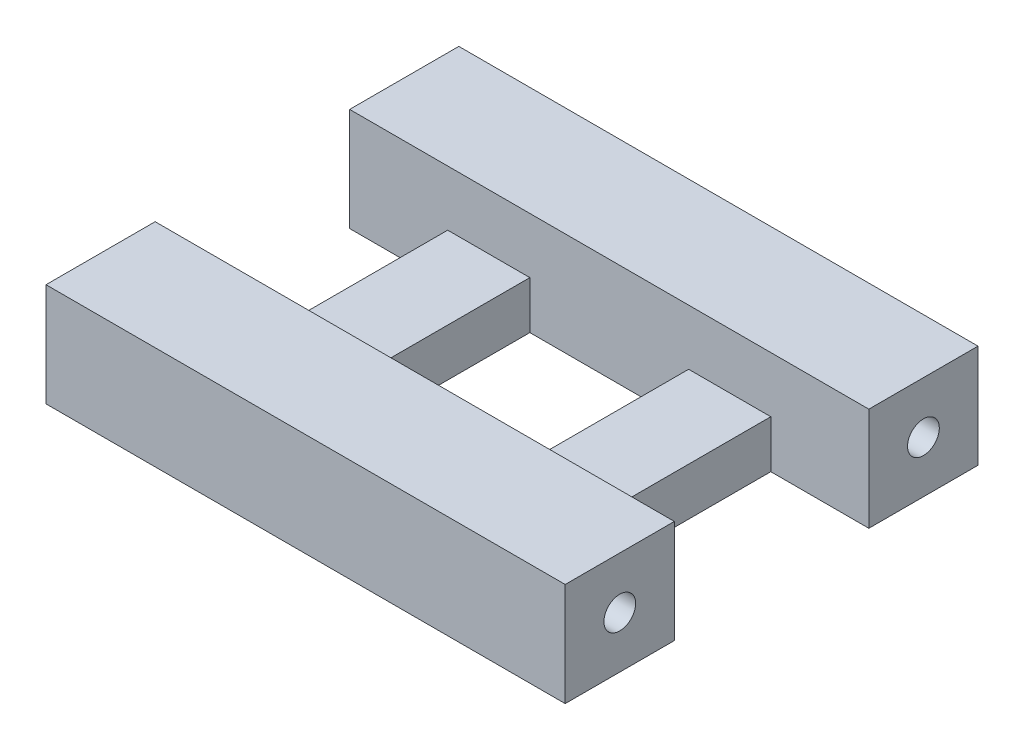
ISO-10303-21;
HEADER;
FILE_DESCRIPTION(('STEP AP214'),'2;1');
FILE_NAME('part.step','',(''),(''),'','','');
FILE_SCHEMA(('AUTOMOTIVE_DESIGN { 1 0 10303 214 1 1 1 1 }'));
ENDSEC;
DATA;
#1=APPLICATION_CONTEXT('core data for automotive mechanical design processes');
#2=APPLICATION_PROTOCOL_DEFINITION('international standard','automotive_design',2000,#1);
#3=PRODUCT_CONTEXT('',#1,'mechanical');
#4=PRODUCT('Part','Part','',(#3));
#5=PRODUCT_RELATED_PRODUCT_CATEGORY('part','',(#4));
#6=PRODUCT_DEFINITION_FORMATION('','',#4);
#7=PRODUCT_DEFINITION_CONTEXT('part definition',#1,'design');
#8=PRODUCT_DEFINITION('design','',#6,#7);
#9=PRODUCT_DEFINITION_SHAPE('','',#8);
#10=(LENGTH_UNIT() NAMED_UNIT(*) SI_UNIT(.MILLI.,.METRE.));
#11=(NAMED_UNIT(*) PLANE_ANGLE_UNIT() SI_UNIT($,.RADIAN.));
#12=(NAMED_UNIT(*) SI_UNIT($,.STERADIAN.) SOLID_ANGLE_UNIT());
#13=UNCERTAINTY_MEASURE_WITH_UNIT(LENGTH_MEASURE(1.E-05),#10,'distance_accuracy_value','');
#14=(GEOMETRIC_REPRESENTATION_CONTEXT(3) GLOBAL_UNCERTAINTY_ASSIGNED_CONTEXT((#13)) GLOBAL_UNIT_ASSIGNED_CONTEXT((#10,
#11,#12)) REPRESENTATION_CONTEXT('',''));
#15=CARTESIAN_POINT('',(0.,0.,0.));
#16=DIRECTION('',(0.,0.,1.));
#17=DIRECTION('',(1.,0.,0.));
#18=AXIS2_PLACEMENT_3D('',#15,#16,#17);
#19=CARTESIAN_POINT('',(0.,6.5,0.));
#20=DIRECTION('',(0.,1.,0.));
#21=DIRECTION('',(0.,0.,1.));
#22=AXIS2_PLACEMENT_3D('',#19,#20,#21);
#23=PLANE('',#22);
#24=DIRECTION('',(1.,0.,0.));
#25=VECTOR('',#24,1.);
#26=CARTESIAN_POINT('',(-15.6068074108547,6.5,-6.74432747551287));
#27=LINE('',#26,#25);
#28=CARTESIAN_POINT('',(-15.6068074108547,6.5,-6.74432747551287));
#29=VERTEX_POINT('',#28);
#30=CARTESIAN_POINT('',(17.0931933520853,6.5,-6.74432747551061));
#31=VERTEX_POINT('',#30);
#32=EDGE_CURVE('E234',#29,#31,#27,.T.);
#33=ORIENTED_EDGE('',*,*,#32,.T.);
#34=DIRECTION('',(0.,0.,-1.));
#35=VECTOR('',#34,1.);
#36=CARTESIAN_POINT('',(17.0931933520853,6.5,-6.74432747551061));
#37=LINE('',#36,#35);
#38=CARTESIAN_POINT('',(17.0931933520853,6.5,-13.6193274755129));
#39=VERTEX_POINT('',#38);
#40=EDGE_CURVE('E245',#31,#39,#37,.T.);
#41=ORIENTED_EDGE('',*,*,#40,.T.);
#42=DIRECTION('',(-1.,0.,0.));
#43=VECTOR('',#42,1.);
#44=CARTESIAN_POINT('',(17.0931933520853,6.5,-13.6193274755129));
#45=LINE('',#44,#43);
#46=CARTESIAN_POINT('',(-15.6068074108547,6.5,-13.6193274755129));
#47=VERTEX_POINT('',#46);
#48=EDGE_CURVE('E228',#39,#47,#45,.T.);
#49=ORIENTED_EDGE('',*,*,#48,.T.);
#50=DIRECTION('',(0.,0.,1.));
#51=VECTOR('',#50,1.);
#52=CARTESIAN_POINT('',(-15.6068074108547,6.5,-13.6193274755129));
#53=LINE('',#52,#51);
#54=EDGE_CURVE('E231',#47,#29,#53,.T.);
#55=ORIENTED_EDGE('',*,*,#54,.T.);
#56=EDGE_LOOP('',(#33,#41,#49,#55));
#57=FACE_BOUND('',#56,.T.);
#58=ADVANCED_FACE('F37',(#57),#23,.T.);
#59=DIRECTION('',(0.,0.,-1.));
#60=VECTOR('',#59,1.);
#61=CARTESIAN_POINT('',(17.093193352086,6.5,12.3806725244867));
#62=LINE('',#61,#60);
#63=CARTESIAN_POINT('',(17.093193352086,6.5,12.3806725244867));
#64=VERTEX_POINT('',#63);
#65=CARTESIAN_POINT('',(17.093193352086,6.5,5.50567252448893));
#66=VERTEX_POINT('',#65);
#67=EDGE_CURVE('E242',#64,#66,#62,.T.);
#68=ORIENTED_EDGE('',*,*,#67,.T.);
#69=DIRECTION('',(-1.,0.,0.));
#70=VECTOR('',#69,1.);
#71=CARTESIAN_POINT('',(-9.43180722011978,6.5,5.50567252448691));
#72=LINE('',#71,#70);
#73=CARTESIAN_POINT('',(-15.606807410854,6.5,5.50567252448715));
#74=VERTEX_POINT('',#73);
#75=EDGE_CURVE('E236',#66,#74,#72,.T.);
#76=ORIENTED_EDGE('',*,*,#75,.T.);
#77=DIRECTION('',(0.,0.,1.));
#78=VECTOR('',#77,1.);
#79=CARTESIAN_POINT('',(-15.606807410854,6.5,5.50567252448715));
#80=LINE('',#79,#78);
#81=CARTESIAN_POINT('',(-15.606807410854,6.5,12.3806725244867));
#82=VERTEX_POINT('',#81);
#83=EDGE_CURVE('E238',#74,#82,#80,.T.);
#84=ORIENTED_EDGE('',*,*,#83,.T.);
#85=DIRECTION('',(1.,0.,0.));
#86=VECTOR('',#85,1.);
#87=CARTESIAN_POINT('',(-15.606807410854,6.5,12.3806725244867));
#88=LINE('',#87,#86);
#89=EDGE_CURVE('E240',#82,#64,#88,.T.);
#90=ORIENTED_EDGE('',*,*,#89,.T.);
#91=EDGE_LOOP('',(#68,#76,#84,#90));
#92=FACE_BOUND('',#91,.T.);
#93=ADVANCED_FACE('F350',(#92),#23,.T.);
#94=CARTESIAN_POINT('',(0.,0.,0.));
#95=DIRECTION('',(0.,1.,0.));
#96=DIRECTION('',(0.,0.,1.));
#97=AXIS2_PLACEMENT_3D('',#94,#95,#96);
#98=PLANE('',#97);
#99=DIRECTION('',(-1.,0.,0.));
#100=VECTOR('',#99,1.);
#101=CARTESIAN_POINT('',(17.0931933520853,0.,-13.6193274755129));
#102=LINE('',#101,#100);
#103=CARTESIAN_POINT('',(17.0931933520853,0.,-13.6193274755129));
#104=VERTEX_POINT('',#103);
#105=CARTESIAN_POINT('',(-15.6068074108547,0.,-13.6193274755129));
#106=VERTEX_POINT('',#105);
#107=EDGE_CURVE('E227',#104,#106,#102,.T.);
#108=ORIENTED_EDGE('',*,*,#107,.F.);
#109=DIRECTION('',(0.,0.,-1.));
#110=VECTOR('',#109,1.);
#111=CARTESIAN_POINT('',(17.0931933520853,0.,-6.74432747551061));
#112=LINE('',#111,#110);
#113=CARTESIAN_POINT('',(17.0931933520853,0.,-6.74432747551061));
#114=VERTEX_POINT('',#113);
#115=EDGE_CURVE('E232',#114,#104,#112,.T.);
#116=ORIENTED_EDGE('',*,*,#115,.F.);
#117=DIRECTION('',(1.,0.,0.));
#118=VECTOR('',#117,1.);
#119=CARTESIAN_POINT('',(10.918193161346,0.,-6.74432747551061));
#120=LINE('',#119,#118);
#121=CARTESIAN_POINT('',(10.918193161346,0.,-6.74432747551061));
#122=VERTEX_POINT('',#121);
#123=EDGE_CURVE('E272',#122,#114,#120,.T.);
#124=ORIENTED_EDGE('',*,*,#123,.F.);
#125=DIRECTION('',(0.,0.,-1.));
#126=VECTOR('',#125,1.);
#127=CARTESIAN_POINT('',(10.918193161346,0.,5.50567252448893));
#128=LINE('',#127,#126);
#129=CARTESIAN_POINT('',(10.918193161346,0.,5.50567252448893));
#130=VERTEX_POINT('',#129);
#131=EDGE_CURVE('E172',#130,#122,#128,.T.);
#132=ORIENTED_EDGE('',*,*,#131,.F.);
#133=DIRECTION('',(-1.,0.,0.));
#134=VECTOR('',#133,1.);
#135=CARTESIAN_POINT('',(17.093193352086,0.,5.50567252448893));
#136=LINE('',#135,#134);
#137=CARTESIAN_POINT('',(17.093193352086,0.,5.50567252448893));
#138=VERTEX_POINT('',#137);
#139=EDGE_CURVE('E268',#138,#130,#136,.T.);
#140=ORIENTED_EDGE('',*,*,#139,.F.);
#141=DIRECTION('',(0.,0.,-1.));
#142=VECTOR('',#141,1.);
#143=CARTESIAN_POINT('',(17.093193352086,0.,12.3806725244867));
#144=LINE('',#143,#142);
#145=CARTESIAN_POINT('',(17.093193352086,0.,12.3806725244867));
#146=VERTEX_POINT('',#145);
#147=EDGE_CURVE('E265',#146,#138,#144,.T.);
#148=ORIENTED_EDGE('',*,*,#147,.F.);
#149=DIRECTION('',(1.,0.,0.));
#150=VECTOR('',#149,1.);
#151=CARTESIAN_POINT('',(-15.606807410854,0.,12.3806725244867));
#152=LINE('',#151,#150);
#153=CARTESIAN_POINT('',(-15.606807410854,0.,12.3806725244867));
#154=VERTEX_POINT('',#153);
#155=EDGE_CURVE('E263',#154,#146,#152,.T.);
#156=ORIENTED_EDGE('',*,*,#155,.F.);
#157=DIRECTION('',(0.,0.,1.));
#158=VECTOR('',#157,1.);
#159=CARTESIAN_POINT('',(-15.606807410854,0.,5.50567252448715));
#160=LINE('',#159,#158);
#161=CARTESIAN_POINT('',(-15.606807410854,0.,5.50567252448715));
#162=VERTEX_POINT('',#161);
#163=EDGE_CURVE('E261',#162,#154,#160,.T.);
#164=ORIENTED_EDGE('',*,*,#163,.F.);
#165=DIRECTION('',(-1.,0.,0.));
#166=VECTOR('',#165,1.);
#167=CARTESIAN_POINT('',(-9.43180722011978,0.,5.50567252448691));
#168=LINE('',#167,#166);
#169=CARTESIAN_POINT('',(-9.43180722011978,0.,5.50567252448691));
#170=VERTEX_POINT('',#169);
#171=EDGE_CURVE('E258',#170,#162,#168,.T.);
#172=ORIENTED_EDGE('',*,*,#171,.F.);
#173=DIRECTION('',(0.,0.,1.));
#174=VECTOR('',#173,1.);
#175=CARTESIAN_POINT('',(-9.43180722011978,0.,-6.74432747551287));
#176=LINE('',#175,#174);
#177=CARTESIAN_POINT('',(-9.43180722011978,0.,-6.74432747551287));
#178=VERTEX_POINT('',#177);
#179=EDGE_CURVE('E255',#178,#170,#176,.T.);
#180=ORIENTED_EDGE('',*,*,#179,.F.);
#181=DIRECTION('',(1.,0.,0.));
#182=VECTOR('',#181,1.);
#183=CARTESIAN_POINT('',(-15.6068074108547,0.,-6.74432747551287));
#184=LINE('',#183,#182);
#185=CARTESIAN_POINT('',(-15.6068074108547,0.,-6.74432747551287));
#186=VERTEX_POINT('',#185);
#187=EDGE_CURVE('E252',#186,#178,#184,.T.);
#188=ORIENTED_EDGE('',*,*,#187,.F.);
#189=DIRECTION('',(0.,0.,1.));
#190=VECTOR('',#189,1.);
#191=CARTESIAN_POINT('',(-15.6068074108547,0.,-13.6193274755129));
#192=LINE('',#191,#190);
#193=EDGE_CURVE('E249',#106,#186,#192,.T.);
#194=ORIENTED_EDGE('',*,*,#193,.F.);
#195=EDGE_LOOP('',(#108,#116,#124,#132,#140,#148,#156,#164,#172,#180,#188,#194));
#196=FACE_BOUND('',#195,.T.);
#197=DIRECTION('',(0.,0.,1.));
#198=VECTOR('',#197,1.);
#199=CARTESIAN_POINT('',(-4.25680702938396,0.,-6.74432747551274));
#200=LINE('',#199,#198);
#201=CARTESIAN_POINT('',(-4.25680702938396,0.,-6.74432747551274));
#202=VERTEX_POINT('',#201);
#203=CARTESIAN_POINT('',(-4.25680702938396,0.,5.50567252448682));
#204=VERTEX_POINT('',#203);
#205=EDGE_CURVE('E201',#202,#204,#200,.T.);
#206=ORIENTED_EDGE('',*,*,#205,.T.);
#207=DIRECTION('',(1.,0.,0.));
#208=VECTOR('',#207,1.);
#209=CARTESIAN_POINT('',(-4.25680702938396,0.,5.50567252448682));
#210=LINE('',#209,#208);
#211=CARTESIAN_POINT('',(5.74319297061473,0.,5.50567252448682));
#212=VERTEX_POINT('',#211);
#213=EDGE_CURVE('E211',#204,#212,#210,.T.);
#214=ORIENTED_EDGE('',*,*,#213,.T.);
#215=DIRECTION('',(0.,0.,-1.));
#216=VECTOR('',#215,1.);
#217=CARTESIAN_POINT('',(5.74319297061473,0.,-6.74432747551274));
#218=LINE('',#217,#216);
#219=CARTESIAN_POINT('',(5.74319297061473,0.,-6.74432747551274));
#220=VERTEX_POINT('',#219);
#221=EDGE_CURVE('E214',#212,#220,#218,.T.);
#222=ORIENTED_EDGE('',*,*,#221,.T.);
#223=DIRECTION('',(-1.,0.,0.));
#224=VECTOR('',#223,1.);
#225=CARTESIAN_POINT('',(-4.25680702938396,0.,-6.74432747551274));
#226=LINE('',#225,#224);
#227=EDGE_CURVE('E217',#220,#202,#226,.T.);
#228=ORIENTED_EDGE('',*,*,#227,.T.);
#229=EDGE_LOOP('',(#206,#214,#222,#228));
#230=FACE_BOUND('',#229,.T.);
#231=ADVANCED_FACE('F284',(#196,#230),#98,.F.);
#232=CARTESIAN_POINT('',(17.0931933520853,6.5,-13.6193274755129));
#233=DIRECTION('',(0.,0.,1.));
#234=DIRECTION('',(1.,0.,0.));
#235=AXIS2_PLACEMENT_3D('',#232,#233,#234);
#236=PLANE('',#235);
#237=ORIENTED_EDGE('',*,*,#107,.T.);
#238=DIRECTION('',(0.,-1.,0.));
#239=VECTOR('',#238,1.);
#240=CARTESIAN_POINT('',(-15.6068074108547,6.5,-13.6193274755129));
#241=LINE('',#240,#239);
#242=EDGE_CURVE('E11',#47,#106,#241,.T.);
#243=ORIENTED_EDGE('',*,*,#242,.F.);
#244=ORIENTED_EDGE('',*,*,#48,.F.);
#245=DIRECTION('',(0.,-1.,0.));
#246=VECTOR('',#245,1.);
#247=CARTESIAN_POINT('',(17.0931933520853,6.5,-13.6193274755129));
#248=LINE('',#247,#246);
#249=EDGE_CURVE('E179',#39,#104,#248,.T.);
#250=ORIENTED_EDGE('',*,*,#249,.T.);
#251=EDGE_LOOP('',(#237,#243,#244,#250));
#252=FACE_BOUND('',#251,.T.);
#253=ADVANCED_FACE('F39',(#252),#236,.F.);
#254=CARTESIAN_POINT('',(-15.6068074108547,6.5,-13.6193274755129));
#255=DIRECTION('',(1.,0.,0.));
#256=DIRECTION('',(0.,0.,-1.));
#257=AXIS2_PLACEMENT_3D('',#254,#255,#256);
#258=PLANE('',#257);
#259=CARTESIAN_POINT('',(-15.6068074108547,3.25,-10.1818274755129));
#260=DIRECTION('',(-1.,0.,0.));
#261=DIRECTION('',(0.,0.,1.));
#262=AXIS2_PLACEMENT_3D('',#259,#260,#261);
#263=CIRCLE('',#262,1.);
#264=CARTESIAN_POINT('',(-15.6068074108547,3.25,-9.18182747551287));
#265=VERTEX_POINT('',#264);
#266=EDGE_CURVE('E328',#265,#265,#263,.T.);
#267=ORIENTED_EDGE('',*,*,#266,.F.);
#268=EDGE_LOOP('',(#267));
#269=FACE_BOUND('',#268,.T.);
#270=ORIENTED_EDGE('',*,*,#193,.T.);
#271=DIRECTION('',(0.,-1.,0.));
#272=VECTOR('',#271,1.);
#273=CARTESIAN_POINT('',(-15.6068074108547,6.5,-6.74432747551287));
#274=LINE('',#273,#272);
#275=EDGE_CURVE('E46',#29,#186,#274,.T.);
#276=ORIENTED_EDGE('',*,*,#275,.F.);
#277=ORIENTED_EDGE('',*,*,#54,.F.);
#278=ORIENTED_EDGE('',*,*,#242,.T.);
#279=EDGE_LOOP('',(#270,#276,#277,#278));
#280=FACE_BOUND('',#279,.T.);
#281=ADVANCED_FACE('F290',(#269,#280),#258,.F.);
#282=CARTESIAN_POINT('',(-9.43180722011978,6.5,-6.74432747551287));
#283=DIRECTION('',(1.,0.,0.));
#284=DIRECTION('',(0.,0.,-1.));
#285=AXIS2_PLACEMENT_3D('',#282,#283,#284);
#286=PLANE('',#285);
#287=DIRECTION('',(0.,-1.,0.));
#288=VECTOR('',#287,1.);
#289=CARTESIAN_POINT('',(-9.43180722011978,6.5,5.50567252448691));
#290=LINE('',#289,#288);
#291=CARTESIAN_POINT('',(-9.43180722011978,3.,5.50567252448715));
#292=VERTEX_POINT('',#291);
#293=EDGE_CURVE('E192',#292,#170,#290,.T.);
#294=ORIENTED_EDGE('',*,*,#293,.F.);
#295=DIRECTION('',(0.,0.,-1.));
#296=VECTOR('',#295,1.);
#297=CARTESIAN_POINT('',(-9.43180722011978,3.,-6.74432747551287));
#298=LINE('',#297,#296);
#299=CARTESIAN_POINT('',(-9.43180722011978,3.,-6.74432747551287));
#300=VERTEX_POINT('',#299);
#301=EDGE_CURVE('E157',#292,#300,#298,.T.);
#302=ORIENTED_EDGE('',*,*,#301,.T.);
#303=DIRECTION('',(0.,-1.,0.));
#304=VECTOR('',#303,1.);
#305=CARTESIAN_POINT('',(-9.43180722011978,6.5,-6.74432747551287));
#306=LINE('',#305,#304);
#307=EDGE_CURVE('E194',#300,#178,#306,.T.);
#308=ORIENTED_EDGE('',*,*,#307,.T.);
#309=ORIENTED_EDGE('',*,*,#179,.T.);
#310=EDGE_LOOP('',(#294,#302,#308,#309));
#311=FACE_BOUND('',#310,.T.);
#312=ADVANCED_FACE('F316',(#311),#286,.F.);
#313=CARTESIAN_POINT('',(-15.606807410854,6.5,5.50567252448715));
#314=DIRECTION('',(1.,0.,0.));
#315=DIRECTION('',(0.,0.,-1.));
#316=AXIS2_PLACEMENT_3D('',#313,#314,#315);
#317=PLANE('',#316);
#318=CARTESIAN_POINT('',(-15.6068074108547,3.25,8.9431725244869));
#319=DIRECTION('',(-1.,0.,0.));
#320=DIRECTION('',(0.,0.,1.));
#321=AXIS2_PLACEMENT_3D('',#318,#319,#320);
#322=CIRCLE('',#321,1.);
#323=CARTESIAN_POINT('',(-15.6068074108547,3.25,9.94317252448691));
#324=VERTEX_POINT('',#323);
#325=EDGE_CURVE('E331',#324,#324,#322,.T.);
#326=ORIENTED_EDGE('',*,*,#325,.F.);
#327=EDGE_LOOP('',(#326));
#328=FACE_BOUND('',#327,.T.);
#329=ORIENTED_EDGE('',*,*,#163,.T.);
#330=DIRECTION('',(0.,-1.,0.));
#331=VECTOR('',#330,1.);
#332=CARTESIAN_POINT('',(-15.606807410854,6.5,12.3806725244867));
#333=LINE('',#332,#331);
#334=EDGE_CURVE('E187',#82,#154,#333,.T.);
#335=ORIENTED_EDGE('',*,*,#334,.F.);
#336=ORIENTED_EDGE('',*,*,#83,.F.);
#337=DIRECTION('',(0.,-1.,0.));
#338=VECTOR('',#337,1.);
#339=CARTESIAN_POINT('',(-15.606807410854,6.5,5.50567252448715));
#340=LINE('',#339,#338);
#341=EDGE_CURVE('E190',#74,#162,#340,.T.);
#342=ORIENTED_EDGE('',*,*,#341,.T.);
#343=EDGE_LOOP('',(#329,#335,#336,#342));
#344=FACE_BOUND('',#343,.T.);
#345=ADVANCED_FACE('F313',(#328,#344),#317,.F.);
#346=CARTESIAN_POINT('',(-15.606807410854,6.5,12.3806725244867));
#347=DIRECTION('',(0.,0.,-1.));
#348=DIRECTION('',(-1.,0.,0.));
#349=AXIS2_PLACEMENT_3D('',#346,#347,#348);
#350=PLANE('',#349);
#351=ORIENTED_EDGE('',*,*,#155,.T.);
#352=DIRECTION('',(0.,-1.,0.));
#353=VECTOR('',#352,1.);
#354=CARTESIAN_POINT('',(17.093193352086,6.5,12.3806725244867));
#355=LINE('',#354,#353);
#356=EDGE_CURVE('E184',#64,#146,#355,.T.);
#357=ORIENTED_EDGE('',*,*,#356,.F.);
#358=ORIENTED_EDGE('',*,*,#89,.F.);
#359=ORIENTED_EDGE('',*,*,#334,.T.);
#360=EDGE_LOOP('',(#351,#357,#358,#359));
#361=FACE_BOUND('',#360,.T.);
#362=ADVANCED_FACE('F308',(#361),#350,.F.);
#363=CARTESIAN_POINT('',(17.093193352086,6.5,12.3806725244867));
#364=DIRECTION('',(-1.,0.,0.));
#365=DIRECTION('',(0.,0.,1.));
#366=AXIS2_PLACEMENT_3D('',#363,#364,#365);
#367=PLANE('',#366);
#368=CARTESIAN_POINT('',(17.093193352086,3.25,8.9431725244869));
#369=DIRECTION('',(-1.,0.,0.));
#370=DIRECTION('',(0.,0.,1.));
#371=AXIS2_PLACEMENT_3D('',#368,#369,#370);
#372=CIRCLE('',#371,1.);
#373=CARTESIAN_POINT('',(17.093193352086,3.25,9.94317252448691));
#374=VERTEX_POINT('',#373);
#375=EDGE_CURVE('E41',#374,#374,#372,.T.);
#376=ORIENTED_EDGE('',*,*,#375,.T.);
#377=EDGE_LOOP('',(#376));
#378=FACE_BOUND('',#377,.T.);
#379=ORIENTED_EDGE('',*,*,#147,.T.);
#380=DIRECTION('',(0.,-1.,0.));
#381=VECTOR('',#380,1.);
#382=CARTESIAN_POINT('',(17.093193352086,6.5,5.50567252448893));
#383=LINE('',#382,#381);
#384=EDGE_CURVE('E177',#66,#138,#383,.T.);
#385=ORIENTED_EDGE('',*,*,#384,.F.);
#386=ORIENTED_EDGE('',*,*,#67,.F.);
#387=ORIENTED_EDGE('',*,*,#356,.T.);
#388=EDGE_LOOP('',(#379,#385,#386,#387));
#389=FACE_BOUND('',#388,.T.);
#390=ADVANCED_FACE('F304',(#378,#389),#367,.F.);
#391=CARTESIAN_POINT('',(17.093193352086,6.5,5.50567252448893));
#392=DIRECTION('',(0.,0.,1.));
#393=DIRECTION('',(1.,0.,0.));
#394=AXIS2_PLACEMENT_3D('',#391,#392,#393);
#395=PLANE('',#394);
#396=DIRECTION('',(0.,-1.,0.));
#397=VECTOR('',#396,1.);
#398=CARTESIAN_POINT('',(10.918193161346,6.5,5.50567252448893));
#399=LINE('',#398,#397);
#400=CARTESIAN_POINT('',(10.918193161346,3.,5.50567252448715));
#401=VERTEX_POINT('',#400);
#402=EDGE_CURVE('E174',#401,#130,#399,.T.);
#403=ORIENTED_EDGE('',*,*,#402,.F.);
#404=DIRECTION('',(-1.,0.,0.));
#405=VECTOR('',#404,1.);
#406=CARTESIAN_POINT('',(19.7931925891453,3.,5.50567252448715));
#407=LINE('',#406,#405);
#408=CARTESIAN_POINT('',(5.74319297061473,3.,5.50567252448715));
#409=VERTEX_POINT('',#408);
#410=EDGE_CURVE('E153',#401,#409,#407,.T.);
#411=ORIENTED_EDGE('',*,*,#410,.T.);
#412=DIRECTION('',(0.,-1.,0.));
#413=VECTOR('',#412,1.);
#414=CARTESIAN_POINT('',(5.74319297061473,6.5,5.50567252448682));
#415=LINE('',#414,#413);
#416=EDGE_CURVE('E223',#409,#212,#415,.T.);
#417=ORIENTED_EDGE('',*,*,#416,.T.);
#418=ORIENTED_EDGE('',*,*,#213,.F.);
#419=DIRECTION('',(0.,-1.,0.));
#420=VECTOR('',#419,1.);
#421=CARTESIAN_POINT('',(-4.25680702938396,6.5,5.50567252448682));
#422=LINE('',#421,#420);
#423=CARTESIAN_POINT('',(-4.25680702938396,3.,5.50567252448682));
#424=VERTEX_POINT('',#423);
#425=EDGE_CURVE('E225',#424,#204,#422,.T.);
#426=ORIENTED_EDGE('',*,*,#425,.F.);
#427=EDGE_CURVE('E54',#424,#292,#407,.T.);
#428=ORIENTED_EDGE('',*,*,#427,.T.);
#429=ORIENTED_EDGE('',*,*,#293,.T.);
#430=ORIENTED_EDGE('',*,*,#171,.T.);
#431=ORIENTED_EDGE('',*,*,#341,.F.);
#432=ORIENTED_EDGE('',*,*,#75,.F.);
#433=ORIENTED_EDGE('',*,*,#384,.T.);
#434=ORIENTED_EDGE('',*,*,#139,.T.);
#435=EDGE_LOOP('',(#403,#411,#417,#418,#426,#428,#429,#430,#431,#432,#433,#434));
#436=FACE_BOUND('',#435,.T.);
#437=ADVANCED_FACE('F299',(#436),#395,.F.);
#438=CARTESIAN_POINT('',(10.918193161346,6.5,5.50567252448893));
#439=DIRECTION('',(-1.,0.,0.));
#440=DIRECTION('',(0.,0.,1.));
#441=AXIS2_PLACEMENT_3D('',#438,#439,#440);
#442=PLANE('',#441);
#443=DIRECTION('',(0.,-1.,0.));
#444=VECTOR('',#443,1.);
#445=CARTESIAN_POINT('',(10.918193161346,6.5,-6.74432747551061));
#446=LINE('',#445,#444);
#447=CARTESIAN_POINT('',(10.918193161346,3.,-6.74432747551287));
#448=VERTEX_POINT('',#447);
#449=EDGE_CURVE('E164',#448,#122,#446,.T.);
#450=ORIENTED_EDGE('',*,*,#449,.F.);
#451=DIRECTION('',(0.,0.,1.));
#452=VECTOR('',#451,1.);
#453=CARTESIAN_POINT('',(10.918193161346,3.,5.50567252448893));
#454=LINE('',#453,#452);
#455=EDGE_CURVE('E150',#448,#401,#454,.T.);
#456=ORIENTED_EDGE('',*,*,#455,.T.);
#457=ORIENTED_EDGE('',*,*,#402,.T.);
#458=ORIENTED_EDGE('',*,*,#131,.T.);
#459=EDGE_LOOP('',(#450,#456,#457,#458));
#460=FACE_BOUND('',#459,.T.);
#461=ADVANCED_FACE('F170',(#460),#442,.F.);
#462=CARTESIAN_POINT('',(10.918193161346,6.5,-6.74432747551061));
#463=DIRECTION('',(0.,0.,-1.));
#464=DIRECTION('',(-1.,0.,0.));
#465=AXIS2_PLACEMENT_3D('',#462,#463,#464);
#466=PLANE('',#465);
#467=ORIENTED_EDGE('',*,*,#123,.T.);
#468=DIRECTION('',(0.,-1.,0.));
#469=VECTOR('',#468,1.);
#470=CARTESIAN_POINT('',(17.0931933520853,6.5,-6.74432747551061));
#471=LINE('',#470,#469);
#472=EDGE_CURVE('E175',#31,#114,#471,.T.);
#473=ORIENTED_EDGE('',*,*,#472,.F.);
#474=ORIENTED_EDGE('',*,*,#32,.F.);
#475=ORIENTED_EDGE('',*,*,#275,.T.);
#476=ORIENTED_EDGE('',*,*,#187,.T.);
#477=ORIENTED_EDGE('',*,*,#307,.F.);
#478=DIRECTION('',(-1.,0.,0.));
#479=VECTOR('',#478,1.);
#480=CARTESIAN_POINT('',(19.7931925891453,3.,-6.74432747551287));
#481=LINE('',#480,#479);
#482=CARTESIAN_POINT('',(-4.25680702938397,3.,-6.74432747551287));
#483=VERTEX_POINT('',#482);
#484=EDGE_CURVE('E168',#483,#300,#481,.T.);
#485=ORIENTED_EDGE('',*,*,#484,.F.);
#486=DIRECTION('',(0.,-1.,0.));
#487=VECTOR('',#486,1.);
#488=CARTESIAN_POINT('',(-4.25680702938396,6.5,-6.74432747551274));
#489=LINE('',#488,#487);
#490=EDGE_CURVE('E220',#483,#202,#489,.T.);
#491=ORIENTED_EDGE('',*,*,#490,.T.);
#492=ORIENTED_EDGE('',*,*,#227,.F.);
#493=DIRECTION('',(0.,-1.,0.));
#494=VECTOR('',#493,1.);
#495=CARTESIAN_POINT('',(5.74319297061473,6.5,-6.74432747551274));
#496=LINE('',#495,#494);
#497=CARTESIAN_POINT('',(5.74319297061473,3.,-6.74432747551274));
#498=VERTEX_POINT('',#497);
#499=EDGE_CURVE('E167',#498,#220,#496,.T.);
#500=ORIENTED_EDGE('',*,*,#499,.F.);
#501=EDGE_CURVE('E62',#448,#498,#481,.T.);
#502=ORIENTED_EDGE('',*,*,#501,.F.);
#503=ORIENTED_EDGE('',*,*,#449,.T.);
#504=EDGE_LOOP('',(#467,#473,#474,#475,#476,#477,#485,#491,#492,#500,#502,#503));
#505=FACE_BOUND('',#504,.T.);
#506=ADVANCED_FACE('F163',(#505),#466,.F.);
#507=CARTESIAN_POINT('',(17.0931933520853,6.5,-6.74432747551061));
#508=DIRECTION('',(-1.,0.,0.));
#509=DIRECTION('',(0.,0.,1.));
#510=AXIS2_PLACEMENT_3D('',#507,#508,#509);
#511=PLANE('',#510);
#512=CARTESIAN_POINT('',(17.0931933520853,3.25,-10.1818274755129));
#513=DIRECTION('',(-1.,0.,0.));
#514=DIRECTION('',(0.,0.,1.));
#515=AXIS2_PLACEMENT_3D('',#512,#513,#514);
#516=CIRCLE('',#515,1.);
#517=CARTESIAN_POINT('',(17.0931933520853,3.25,-9.18182747551287));
#518=VERTEX_POINT('',#517);
#519=EDGE_CURVE('E196',#518,#518,#516,.T.);
#520=ORIENTED_EDGE('',*,*,#519,.T.);
#521=EDGE_LOOP('',(#520));
#522=FACE_BOUND('',#521,.T.);
#523=ORIENTED_EDGE('',*,*,#115,.T.);
#524=ORIENTED_EDGE('',*,*,#249,.F.);
#525=ORIENTED_EDGE('',*,*,#40,.F.);
#526=ORIENTED_EDGE('',*,*,#472,.T.);
#527=EDGE_LOOP('',(#523,#524,#525,#526));
#528=FACE_BOUND('',#527,.T.);
#529=ADVANCED_FACE('F294',(#522,#528),#511,.F.);
#530=CARTESIAN_POINT('',(-4.25680702938396,6.5,-6.74432747551274));
#531=DIRECTION('',(1.,0.,0.));
#532=DIRECTION('',(0.,0.,-1.));
#533=AXIS2_PLACEMENT_3D('',#530,#531,#532);
#534=PLANE('',#533);
#535=DIRECTION('',(0.,0.,-1.));
#536=VECTOR('',#535,1.);
#537=CARTESIAN_POINT('',(-4.25680702938396,3.,-6.74432747551274));
#538=LINE('',#537,#536);
#539=EDGE_CURVE('E158',#424,#483,#538,.T.);
#540=ORIENTED_EDGE('',*,*,#539,.F.);
#541=ORIENTED_EDGE('',*,*,#425,.T.);
#542=ORIENTED_EDGE('',*,*,#205,.F.);
#543=ORIENTED_EDGE('',*,*,#490,.F.);
#544=EDGE_LOOP('',(#540,#541,#542,#543));
#545=FACE_BOUND('',#544,.T.);
#546=ADVANCED_FACE('F321',(#545),#534,.T.);
#547=CARTESIAN_POINT('',(5.74319297061473,6.5,-6.74432747551274));
#548=DIRECTION('',(-1.,0.,0.));
#549=DIRECTION('',(0.,0.,1.));
#550=AXIS2_PLACEMENT_3D('',#547,#548,#549);
#551=PLANE('',#550);
#552=DIRECTION('',(0.,0.,1.));
#553=VECTOR('',#552,1.);
#554=CARTESIAN_POINT('',(5.74319297061473,3.,-6.74432747551274));
#555=LINE('',#554,#553);
#556=EDGE_CURVE('E327',#498,#409,#555,.T.);
#557=ORIENTED_EDGE('',*,*,#556,.F.);
#558=ORIENTED_EDGE('',*,*,#499,.T.);
#559=ORIENTED_EDGE('',*,*,#221,.F.);
#560=ORIENTED_EDGE('',*,*,#416,.F.);
#561=EDGE_LOOP('',(#557,#558,#559,#560));
#562=FACE_BOUND('',#561,.T.);
#563=ADVANCED_FACE('F326',(#562),#551,.T.);
#564=CARTESIAN_POINT('',(19.7931925891453,3.,-6.74432747551287));
#565=DIRECTION('',(0.,-1.,0.));
#566=DIRECTION('',(0.,0.,-1.));
#567=AXIS2_PLACEMENT_3D('',#564,#565,#566);
#568=PLANE('',#567);
#569=ORIENTED_EDGE('',*,*,#501,.T.);
#570=ORIENTED_EDGE('',*,*,#556,.T.);
#571=ORIENTED_EDGE('',*,*,#410,.F.);
#572=ORIENTED_EDGE('',*,*,#455,.F.);
#573=EDGE_LOOP('',(#569,#570,#571,#572));
#574=FACE_BOUND('',#573,.T.);
#575=ADVANCED_FACE('F151',(#574),#568,.F.);
#576=ORIENTED_EDGE('',*,*,#427,.F.);
#577=ORIENTED_EDGE('',*,*,#539,.T.);
#578=ORIENTED_EDGE('',*,*,#484,.T.);
#579=ORIENTED_EDGE('',*,*,#301,.F.);
#580=EDGE_LOOP('',(#576,#577,#578,#579));
#581=FACE_BOUND('',#580,.T.);
#582=ADVANCED_FACE('F380',(#581),#568,.F.);
#583=CARTESIAN_POINT('',(19.7931925891453,3.25,-10.1818274755129));
#584=DIRECTION('',(-1.,0.,0.));
#585=DIRECTION('',(0.,0.,1.));
#586=AXIS2_PLACEMENT_3D('',#583,#584,#585);
#587=CYLINDRICAL_SURFACE('',#586,1.);
#588=ORIENTED_EDGE('',*,*,#266,.T.);
#589=EDGE_LOOP('',(#588));
#590=FACE_BOUND('',#589,.T.);
#591=ORIENTED_EDGE('',*,*,#519,.F.);
#592=EDGE_LOOP('',(#591));
#593=FACE_BOUND('',#592,.T.);
#594=ADVANCED_FACE('F375',(#590,#593),#587,.F.);
#595=CARTESIAN_POINT('',(19.7931925891453,3.25,8.9431725244869));
#596=DIRECTION('',(-1.,0.,0.));
#597=DIRECTION('',(0.,0.,1.));
#598=AXIS2_PLACEMENT_3D('',#595,#596,#597);
#599=CYLINDRICAL_SURFACE('',#598,1.);
#600=ORIENTED_EDGE('',*,*,#325,.T.);
#601=EDGE_LOOP('',(#600));
#602=FACE_BOUND('',#601,.T.);
#603=ORIENTED_EDGE('',*,*,#375,.F.);
#604=EDGE_LOOP('',(#603));
#605=FACE_BOUND('',#604,.T.);
#606=ADVANCED_FACE('F338',(#602,#605),#599,.F.);
#607=CLOSED_SHELL('',(#58,#93,#231,#253,#281,#312,#345,#362,#390,#437,#461,#506,#529,#546,#563,
#575,#582,#594,#606));
#608=MANIFOLD_SOLID_BREP('B2',#607);
#609=ADVANCED_BREP_SHAPE_REPRESENTATION('',(#18,#608),#14);
#610=SHAPE_DEFINITION_REPRESENTATION(#9,#609);
ENDSEC;
END-ISO-10303-21;
